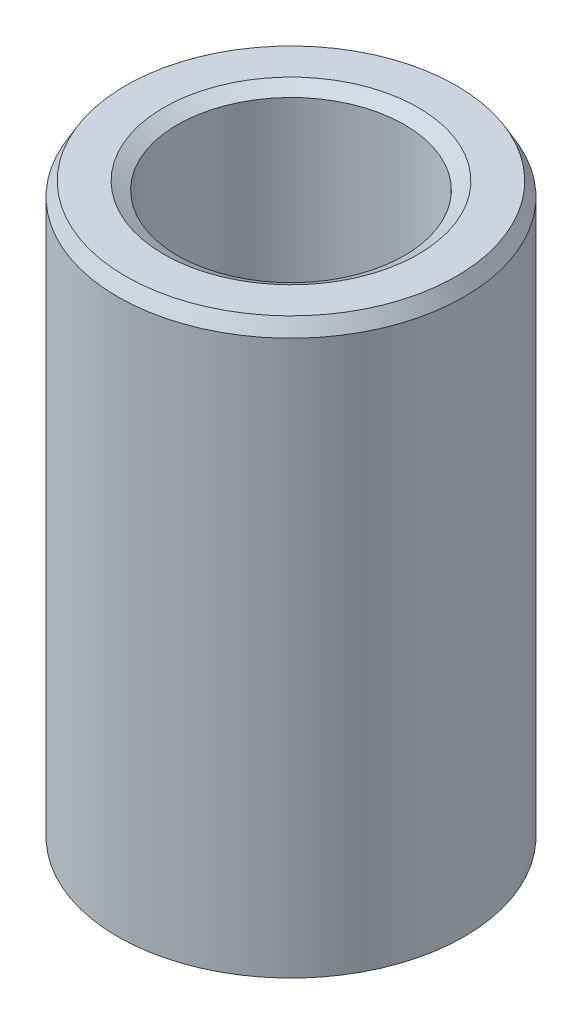
ISO-10303-21;
HEADER;
FILE_DESCRIPTION(('STEP AP214'),'2;1');
FILE_NAME('part.step','',(''),(''),'','','');
FILE_SCHEMA(('AUTOMOTIVE_DESIGN { 1 0 10303 214 1 1 1 1 }'));
ENDSEC;
DATA;
#1=APPLICATION_CONTEXT('core data for automotive mechanical design processes');
#2=APPLICATION_PROTOCOL_DEFINITION('international standard','automotive_design',2000,#1);
#3=PRODUCT_CONTEXT('',#1,'mechanical');
#4=PRODUCT('Part','Part','',(#3));
#5=PRODUCT_RELATED_PRODUCT_CATEGORY('part','',(#4));
#6=PRODUCT_DEFINITION_FORMATION('','',#4);
#7=PRODUCT_DEFINITION_CONTEXT('part definition',#1,'design');
#8=PRODUCT_DEFINITION('design','',#6,#7);
#9=PRODUCT_DEFINITION_SHAPE('','',#8);
#10=(LENGTH_UNIT() NAMED_UNIT(*) SI_UNIT(.MILLI.,.METRE.));
#11=(NAMED_UNIT(*) PLANE_ANGLE_UNIT() SI_UNIT($,.RADIAN.));
#12=(NAMED_UNIT(*) SI_UNIT($,.STERADIAN.) SOLID_ANGLE_UNIT());
#13=UNCERTAINTY_MEASURE_WITH_UNIT(LENGTH_MEASURE(1.E-05),#10,'distance_accuracy_value','');
#14=(GEOMETRIC_REPRESENTATION_CONTEXT(3) GLOBAL_UNCERTAINTY_ASSIGNED_CONTEXT((#13)) GLOBAL_UNIT_ASSIGNED_CONTEXT((#10,
#11,#12)) REPRESENTATION_CONTEXT('',''));
#15=CARTESIAN_POINT('',(0.,0.,0.));
#16=DIRECTION('',(0.,0.,1.));
#17=DIRECTION('',(1.,0.,0.));
#18=AXIS2_PLACEMENT_3D('',#15,#16,#17);
#19=CARTESIAN_POINT('',(0.,166.203326574987,0.));
#20=DIRECTION('',(0.,-1.,0.));
#21=DIRECTION('',(0.,0.,-1.));
#22=AXIS2_PLACEMENT_3D('',#19,#20,#21);
#23=CYLINDRICAL_SURFACE('',#22,50.);
#24=CARTESIAN_POINT('',(0.,2.29415611654041,0.));
#25=DIRECTION('',(0.,1.,0.));
#26=DIRECTION('',(0.,0.,1.));
#27=AXIS2_PLACEMENT_3D('',#24,#25,#26);
#28=CIRCLE('',#27,50.);
#29=CARTESIAN_POINT('',(0.,2.29415611654041,-50.));
#30=VERTEX_POINT('',#29);
#31=EDGE_CURVE('E10',#30,#30,#28,.T.);
#32=CARTESIAN_POINT('',(0.,162.229731620644,0.));
#33=DIRECTION('',(0.,1.,0.));
#34=DIRECTION('',(0.,0.,1.));
#35=AXIS2_PLACEMENT_3D('',#32,#33,#34);
#36=CIRCLE('',#35,50.);
#37=CARTESIAN_POINT('',(0.,162.229731620644,-50.));
#38=VERTEX_POINT('',#37);
#39=EDGE_CURVE('E50',#38,#38,#36,.F.);
#40=CARTESIAN_POINT('',(0.,2.29415611654041,-50.));
#41=CARTESIAN_POINT('',(0.,3.96015169470816,-50.));
#42=CARTESIAN_POINT('',(0.,5.62614727287591,-50.));
#43=CARTESIAN_POINT('',(0.,8.9581384292114,-50.));
#44=CARTESIAN_POINT('',(0.,10.6241340073792,-50.));
#45=CARTESIAN_POINT('',(0.,13.9561251637146,-50.));
#46=CARTESIAN_POINT('',(0.,15.6221207418824,-50.));
#47=CARTESIAN_POINT('',(0.,18.9541118982179,-50.));
#48=CARTESIAN_POINT('',(0.,20.6201074763856,-50.));
#49=CARTESIAN_POINT('',(0.,23.9520986327211,-50.));
#50=CARTESIAN_POINT('',(0.,25.6180942108889,-50.));
#51=CARTESIAN_POINT('',(0.,28.9500853672244,-50.));
#52=CARTESIAN_POINT('',(0.,30.6160809453921,-50.));
#53=CARTESIAN_POINT('',(0.,33.9480721017276,-50.));
#54=CARTESIAN_POINT('',(0.,35.6140676798954,-50.));
#55=CARTESIAN_POINT('',(0.,38.9460588362308,-50.));
#56=CARTESIAN_POINT('',(0.,40.6120544143986,-50.));
#57=CARTESIAN_POINT('',(0.,43.9440455707341,-50.));
#58=CARTESIAN_POINT('',(0.,45.6100411489018,-50.));
#59=CARTESIAN_POINT('',(0.,48.9420323052373,-50.));
#60=CARTESIAN_POINT('',(0.,50.6080278834051,-50.));
#61=CARTESIAN_POINT('',(0.,53.9400190397406,-50.));
#62=CARTESIAN_POINT('',(0.,55.6060146179083,-50.));
#63=CARTESIAN_POINT('',(0.,58.9380057742438,-50.));
#64=CARTESIAN_POINT('',(0.,60.6040013524115,-50.));
#65=CARTESIAN_POINT('',(0.,63.935992508747,-50.));
#66=CARTESIAN_POINT('',(0.,65.6019880869148,-50.));
#67=CARTESIAN_POINT('',(0.,68.9339792432503,-50.));
#68=CARTESIAN_POINT('',(0.,70.599974821418,-50.));
#69=CARTESIAN_POINT('',(0.,73.9319659777535,-50.));
#70=CARTESIAN_POINT('',(0.,75.5979615559213,-50.));
#71=CARTESIAN_POINT('',(0.,78.9299527122568,-50.));
#72=CARTESIAN_POINT('',(0.,80.5959482904245,-50.));
#73=CARTESIAN_POINT('',(0.,83.92793944676,-50.));
#74=CARTESIAN_POINT('',(0.,85.5939350249277,-50.));
#75=CARTESIAN_POINT('',(0.,88.9259261812632,-50.));
#76=CARTESIAN_POINT('',(0.,90.591921759431,-50.));
#77=CARTESIAN_POINT('',(0.,93.9239129157665,-50.));
#78=CARTESIAN_POINT('',(0.,95.5899084939342,-50.));
#79=CARTESIAN_POINT('',(0.,98.9218996502697,-50.));
#80=CARTESIAN_POINT('',(0.,100.587895228437,-50.));
#81=CARTESIAN_POINT('',(0.,103.919886384773,-50.));
#82=CARTESIAN_POINT('',(0.,105.585881962941,-50.));
#83=CARTESIAN_POINT('',(0.,108.917873119276,-50.));
#84=CARTESIAN_POINT('',(0.,110.583868697444,-50.));
#85=CARTESIAN_POINT('',(0.,113.915859853779,-50.));
#86=CARTESIAN_POINT('',(0.,115.581855431947,-50.));
#87=CARTESIAN_POINT('',(0.,118.913846588283,-50.));
#88=CARTESIAN_POINT('',(0.,120.57984216645,-50.));
#89=CARTESIAN_POINT('',(0.,123.911833322786,-50.));
#90=CARTESIAN_POINT('',(0.,125.577828900954,-50.));
#91=CARTESIAN_POINT('',(0.,128.909820057289,-50.));
#92=CARTESIAN_POINT('',(0.,130.575815635457,-50.));
#93=CARTESIAN_POINT('',(0.,133.907806791792,-50.));
#94=CARTESIAN_POINT('',(0.,135.57380236996,-50.));
#95=CARTESIAN_POINT('',(0.,138.905793526296,-50.));
#96=CARTESIAN_POINT('',(0.,140.571789104463,-50.));
#97=CARTESIAN_POINT('',(0.,143.903780260799,-50.));
#98=CARTESIAN_POINT('',(0.,145.569775838967,-50.));
#99=CARTESIAN_POINT('',(0.,148.901766995302,-50.));
#100=CARTESIAN_POINT('',(0.,150.56776257347,-50.));
#101=CARTESIAN_POINT('',(0.,153.899753729805,-50.));
#102=CARTESIAN_POINT('',(0.,155.565749307973,-50.));
#103=CARTESIAN_POINT('',(0.,158.897740464309,-50.));
#104=CARTESIAN_POINT('',(0.,160.563736042476,-50.));
#105=CARTESIAN_POINT('',(0.,162.229731620644,-50.));
#106=B_SPLINE_CURVE_WITH_KNOTS('',3,(#40,#41,#42,#43,#44,#45,#46,#47,#48,#49,#50,#51,#52,#53,
#54,#55,#56,#57,#58,#59,#60,#61,#62,#63,#64,#65,#66,#67,#68,#69,#70,#71,#72,#73,#74,#75,#76,#77,
#78,#79,#80,#81,#82,#83,#84,#85,#86,#87,#88,#89,#90,#91,#92,#93,#94,#95,#96,#97,#98,#99,#100,
#101,#102,#103,#104,#105),.UNSPECIFIED.,.F.,.F.,(4,2,2,2,2,2,2,2,2,2,2,2,2,2,2,2,2,2,2,2,2,2,2,
2,2,2,2,2,2,2,2,2,4),(0.,4.99798673450325,9.99597346900649,14.9939602035097,19.991946938013,
24.9899336725162,29.9879204070194,34.9859071415227,39.9838938760259,44.9818806105292,
49.9798673450324,54.9778540795356,59.9758408140389,64.9738275485421,69.9718142830454,
74.9698010175486,79.9677877520518,84.9657744865551,89.9637612210583,94.9617479555616,
99.9597346900648,104.957721424568,109.955708159071,114.953694893575,119.951681628078,
124.949668362581,129.947655097084,134.945641831587,139.943628566091,144.941615300594,
149.939602035097,154.9375887696,159.935575504104),.UNSPECIFIED.);
#107=EDGE_CURVE('BSEAM39',#30,#38,#106,.T.);
#108=ORIENTED_EDGE('',*,*,#31,.T.);
#109=ORIENTED_EDGE('',*,*,#39,.T.);
#110=ORIENTED_EDGE('',*,*,#107,.T.);
#111=ORIENTED_EDGE('',*,*,#107,.F.);
#112=EDGE_LOOP('',(#108,#110,#109,#111));
#113=FACE_BOUND('',#112,.T.);
#114=ADVANCED_FACE('F39',(#113),#23,.T.);
#115=CARTESIAN_POINT('',(0.,166.203326574987,0.));
#116=DIRECTION('',(0.,1.,0.));
#117=DIRECTION('',(0.,0.,1.));
#118=AXIS2_PLACEMENT_3D('',#115,#116,#117);
#119=PLANE('',#118);
#120=CARTESIAN_POINT('',(0.,166.203326574987,0.));
#121=DIRECTION('',(0.,1.,0.));
#122=DIRECTION('',(0.,0.,1.));
#123=AXIS2_PLACEMENT_3D('',#120,#121,#122);
#124=CIRCLE('',#123,36.715613234674);
#125=CARTESIAN_POINT('',(0.,166.203326574987,36.715613234674));
#126=VERTEX_POINT('',#125);
#127=EDGE_CURVE('E58',#126,#126,#124,.F.);
#128=ORIENTED_EDGE('',*,*,#127,.T.);
#129=EDGE_LOOP('',(#128));
#130=FACE_BOUND('',#129,.T.);
#131=CARTESIAN_POINT('',(0.,166.203326574987,0.));
#132=DIRECTION('',(0.,1.,0.));
#133=DIRECTION('',(0.,0.,1.));
#134=AXIS2_PLACEMENT_3D('',#131,#132,#133);
#135=CIRCLE('',#134,47.7058438834597);
#136=CARTESIAN_POINT('',(0.,166.203326574987,47.7058438834597));
#137=VERTEX_POINT('',#136);
#138=EDGE_CURVE('E61',#137,#137,#135,.T.);
#139=ORIENTED_EDGE('',*,*,#138,.T.);
#140=EDGE_LOOP('',(#139));
#141=FACE_BOUND('',#140,.T.);
#142=ADVANCED_FACE('F88',(#130,#141),#119,.T.);
#143=CARTESIAN_POINT('',(0.,0.,0.));
#144=DIRECTION('',(0.,1.,0.));
#145=DIRECTION('',(0.,0.,1.));
#146=AXIS2_PLACEMENT_3D('',#143,#144,#145);
#147=PLANE('',#146);
#148=CARTESIAN_POINT('',(0.,0.,0.));
#149=DIRECTION('',(0.,1.,0.));
#150=DIRECTION('',(0.,0.,1.));
#151=AXIS2_PLACEMENT_3D('',#148,#149,#150);
#152=CIRCLE('',#151,35.0361743968715);
#153=CARTESIAN_POINT('',(0.,0.,35.0361743968715));
#154=VERTEX_POINT('',#153);
#155=EDGE_CURVE('E51',#154,#154,#152,.T.);
#156=ORIENTED_EDGE('',*,*,#155,.T.);
#157=EDGE_LOOP('',(#156));
#158=FACE_BOUND('',#157,.T.);
#159=CARTESIAN_POINT('',(0.,0.,0.));
#160=DIRECTION('',(0.,1.,0.));
#161=DIRECTION('',(0.,0.,1.));
#162=AXIS2_PLACEMENT_3D('',#159,#160,#161);
#163=CIRCLE('',#162,46.0264050456571);
#164=CARTESIAN_POINT('',(0.,0.,46.0264050456571));
#165=VERTEX_POINT('',#164);
#166=EDGE_CURVE('E54',#165,#165,#163,.F.);
#167=ORIENTED_EDGE('',*,*,#166,.T.);
#168=EDGE_LOOP('',(#167));
#169=FACE_BOUND('',#168,.T.);
#170=ADVANCED_FACE('F83',(#158,#169),#147,.F.);
#171=CARTESIAN_POINT('',(0.,166.203326574987,0.));
#172=DIRECTION('',(0.,-1.,0.));
#173=DIRECTION('',(0.,0.,-1.));
#174=AXIS2_PLACEMENT_3D('',#171,#172,#173);
#175=CYLINDRICAL_SURFACE('',#174,32.7420182803311);
#176=CARTESIAN_POINT('',(0.,163.909170458446,0.));
#177=DIRECTION('',(0.,1.,0.));
#178=DIRECTION('',(0.,0.,1.));
#179=AXIS2_PLACEMENT_3D('',#176,#177,#178);
#180=CIRCLE('',#179,32.7420182803311);
#181=CARTESIAN_POINT('',(0.,163.909170458446,-32.7420182803311));
#182=VERTEX_POINT('',#181);
#183=EDGE_CURVE('E67',#182,#182,#180,.T.);
#184=CARTESIAN_POINT('',(0.,3.97359495434277,0.));
#185=DIRECTION('',(0.,1.,0.));
#186=DIRECTION('',(0.,0.,1.));
#187=AXIS2_PLACEMENT_3D('',#184,#185,#186);
#188=CIRCLE('',#187,32.7420182803311);
#189=CARTESIAN_POINT('',(0.,3.97359495434277,-32.7420182803311));
#190=VERTEX_POINT('',#189);
#191=EDGE_CURVE('E69',#190,#190,#188,.F.);
#192=CARTESIAN_POINT('',(0.,163.909170458446,-32.7420182803311));
#193=CARTESIAN_POINT('',(0.,162.243174880279,-32.7420182803311));
#194=CARTESIAN_POINT('',(0.,160.577179302111,-32.7420182803311));
#195=CARTESIAN_POINT('',(0.,157.245188145776,-32.7420182803311));
#196=CARTESIAN_POINT('',(0.,155.579192567608,-32.7420182803311));
#197=CARTESIAN_POINT('',(0.,152.247201411272,-32.7420182803311));
#198=CARTESIAN_POINT('',(0.,150.581205833104,-32.7420182803311));
#199=CARTESIAN_POINT('',(0.,147.249214676769,-32.7420182803311));
#200=CARTESIAN_POINT('',(0.,145.583219098601,-32.7420182803311));
#201=CARTESIAN_POINT('',(0.,142.251227942266,-32.7420182803311));
#202=CARTESIAN_POINT('',(0.,140.585232364098,-32.7420182803311));
#203=CARTESIAN_POINT('',(0.,137.253241207763,-32.7420182803311));
#204=CARTESIAN_POINT('',(0.,135.587245629595,-32.7420182803311));
#205=CARTESIAN_POINT('',(0.,132.255254473259,-32.7420182803311));
#206=CARTESIAN_POINT('',(0.,130.589258895092,-32.7420182803311));
#207=CARTESIAN_POINT('',(0.,127.257267738756,-32.7420182803311));
#208=CARTESIAN_POINT('',(0.,125.591272160588,-32.7420182803311));
#209=CARTESIAN_POINT('',(0.,122.259281004253,-32.7420182803311));
#210=CARTESIAN_POINT('',(0.,120.593285426085,-32.7420182803311));
#211=CARTESIAN_POINT('',(0.,117.26129426975,-32.7420182803311));
#212=CARTESIAN_POINT('',(0.,115.595298691582,-32.7420182803311));
#213=CARTESIAN_POINT('',(0.,112.263307535246,-32.7420182803311));
#214=CARTESIAN_POINT('',(0.,110.597311957079,-32.7420182803311));
#215=CARTESIAN_POINT('',(0.,107.265320800743,-32.7420182803311));
#216=CARTESIAN_POINT('',(0.,105.599325222575,-32.7420182803311));
#217=CARTESIAN_POINT('',(0.,102.26733406624,-32.7420182803311));
#218=CARTESIAN_POINT('',(0.,100.601338488072,-32.7420182803311));
#219=CARTESIAN_POINT('',(0.,97.2693473317366,-32.7420182803311));
#220=CARTESIAN_POINT('',(0.,95.6033517535689,-32.7420182803311));
#221=CARTESIAN_POINT('',(0.,92.2713605972334,-32.7420182803311));
#222=CARTESIAN_POINT('',(0.,90.6053650190656,-32.7420182803311));
#223=CARTESIAN_POINT('',(0.,87.2733738627301,-32.7420182803311));
#224=CARTESIAN_POINT('',(0.,85.6073782845624,-32.7420182803311));
#225=CARTESIAN_POINT('',(0.,82.2753871282269,-32.7420182803311));
#226=CARTESIAN_POINT('',(0.,80.6093915500591,-32.7420182803311));
#227=CARTESIAN_POINT('',(0.,77.2774003937237,-32.7420182803311));
#228=CARTESIAN_POINT('',(0.,75.6114048155559,-32.7420182803311));
#229=CARTESIAN_POINT('',(0.,72.2794136592204,-32.7420182803311));
#230=CARTESIAN_POINT('',(0.,70.6134180810527,-32.7420182803311));
#231=CARTESIAN_POINT('',(0.,67.2814269247172,-32.7420182803311));
#232=CARTESIAN_POINT('',(0.,65.6154313465494,-32.7420182803311));
#233=CARTESIAN_POINT('',(0.,62.2834401902139,-32.7420182803311));
#234=CARTESIAN_POINT('',(0.,60.6174446120462,-32.7420182803311));
#235=CARTESIAN_POINT('',(0.,57.2854534557107,-32.7420182803311));
#236=CARTESIAN_POINT('',(0.,55.6194578775429,-32.7420182803311));
#237=CARTESIAN_POINT('',(0.,52.2874667212074,-32.7420182803311));
#238=CARTESIAN_POINT('',(0.,50.6214711430397,-32.7420182803311));
#239=CARTESIAN_POINT('',(0.,47.2894799867042,-32.7420182803311));
#240=CARTESIAN_POINT('',(0.,45.6234844085365,-32.7420182803311));
#241=CARTESIAN_POINT('',(0.,42.291493252201,-32.7420182803311));
#242=CARTESIAN_POINT('',(0.,40.6254976740332,-32.7420182803311));
#243=CARTESIAN_POINT('',(0.,37.2935065176977,-32.7420182803311));
#244=CARTESIAN_POINT('',(0.,35.62751093953,-32.7420182803311));
#245=CARTESIAN_POINT('',(0.,32.2955197831945,-32.7420182803311));
#246=CARTESIAN_POINT('',(0.,30.6295242050267,-32.7420182803311));
#247=CARTESIAN_POINT('',(0.,27.2975330486912,-32.7420182803311));
#248=CARTESIAN_POINT('',(0.,25.6315374705235,-32.7420182803311));
#249=CARTESIAN_POINT('',(0.,22.299546314188,-32.7420182803311));
#250=CARTESIAN_POINT('',(0.,20.6335507360202,-32.7420182803311));
#251=CARTESIAN_POINT('',(0.,17.3015595796848,-32.7420182803311));
#252=CARTESIAN_POINT('',(0.,15.635564001517,-32.7420182803311));
#253=CARTESIAN_POINT('',(0.,12.3035728451815,-32.7420182803311));
#254=CARTESIAN_POINT('',(0.,10.6375772670138,-32.7420182803311));
#255=CARTESIAN_POINT('',(0.,7.30558611067827,-32.7420182803311));
#256=CARTESIAN_POINT('',(0.,5.63959053251052,-32.7420182803311));
#257=CARTESIAN_POINT('',(0.,3.97359495434277,-32.7420182803311));
#258=B_SPLINE_CURVE_WITH_KNOTS('',3,(#192,#193,#194,#195,#196,#197,#198,#199,#200,#201,#202,
#203,#204,#205,#206,#207,#208,#209,#210,#211,#212,#213,#214,#215,#216,#217,#218,#219,#220,#221,
#222,#223,#224,#225,#226,#227,#228,#229,#230,#231,#232,#233,#234,#235,#236,#237,#238,#239,#240,
#241,#242,#243,#244,#245,#246,#247,#248,#249,#250,#251,#252,#253,#254,#255,#256,#257),
.UNSPECIFIED.,.F.,.F.,(4,2,2,2,2,2,2,2,2,2,2,2,2,2,2,2,2,2,2,2,2,2,2,2,2,2,2,2,2,2,2,2,4),(0.,
4.99798673450322,9.99597346900646,14.9939602035097,19.991946938013,24.9899336725162,
29.9879204070194,34.9859071415227,39.9838938760259,44.9818806105292,49.9798673450324,
54.9778540795356,59.9758408140389,64.9738275485421,69.9718142830454,74.9698010175486,
79.9677877520518,84.9657744865551,89.9637612210583,94.9617479555616,99.9597346900648,
104.957721424568,109.955708159071,114.953694893575,119.951681628078,124.949668362581,
129.947655097084,134.945641831587,139.943628566091,144.941615300594,149.939602035097,
154.9375887696,159.935575504104),.UNSPECIFIED.);
#259=EDGE_CURVE('BSEAM71',#182,#190,#258,.T.);
#260=ORIENTED_EDGE('',*,*,#183,.T.);
#261=ORIENTED_EDGE('',*,*,#191,.T.);
#262=ORIENTED_EDGE('',*,*,#259,.T.);
#263=ORIENTED_EDGE('',*,*,#259,.F.);
#264=EDGE_LOOP('',(#260,#262,#261,#263));
#265=FACE_BOUND('',#264,.T.);
#266=ADVANCED_FACE('F71',(#265),#175,.F.);
#267=CARTESIAN_POINT('',(0.,163.909170458446,0.));
#268=DIRECTION('',(0.,1.,0.));
#269=DIRECTION('',(0.,0.,1.));
#270=AXIS2_PLACEMENT_3D('',#267,#268,#269);
#271=CONICAL_SURFACE('',#270,32.7420182803311,1.0471975511966);
#272=ORIENTED_EDGE('',*,*,#127,.F.);
#273=EDGE_LOOP('',(#272));
#274=FACE_BOUND('',#273,.T.);
#275=ORIENTED_EDGE('',*,*,#183,.F.);
#276=EDGE_LOOP('',(#275));
#277=FACE_BOUND('',#276,.T.);
#278=ADVANCED_FACE('F77',(#274,#277),#271,.F.);
#279=CARTESIAN_POINT('',(0.,0.,0.));
#280=DIRECTION('',(0.,-1.,0.));
#281=DIRECTION('',(0.,0.,-1.));
#282=AXIS2_PLACEMENT_3D('',#279,#280,#281);
#283=CONICAL_SURFACE('',#282,35.0361743968715,0.523598775598294);
#284=ORIENTED_EDGE('',*,*,#191,.F.);
#285=EDGE_LOOP('',(#284));
#286=FACE_BOUND('',#285,.T.);
#287=ORIENTED_EDGE('',*,*,#155,.F.);
#288=EDGE_LOOP('',(#287));
#289=FACE_BOUND('',#288,.T.);
#290=ADVANCED_FACE('F73',(#286,#289),#283,.F.);
#291=CARTESIAN_POINT('',(0.,2.29415611654041,0.));
#292=DIRECTION('',(0.,1.,0.));
#293=DIRECTION('',(0.,0.,1.));
#294=AXIS2_PLACEMENT_3D('',#291,#292,#293);
#295=CONICAL_SURFACE('',#294,50.,1.0471975511966);
#296=ORIENTED_EDGE('',*,*,#166,.F.);
#297=EDGE_LOOP('',(#296));
#298=FACE_BOUND('',#297,.T.);
#299=ORIENTED_EDGE('',*,*,#31,.F.);
#300=EDGE_LOOP('',(#299));
#301=FACE_BOUND('',#300,.T.);
#302=ADVANCED_FACE('F76',(#298,#301),#295,.T.);
#303=CARTESIAN_POINT('',(0.,166.203326574987,0.));
#304=DIRECTION('',(0.,-1.,0.));
#305=DIRECTION('',(0.,0.,-1.));
#306=AXIS2_PLACEMENT_3D('',#303,#304,#305);
#307=CONICAL_SURFACE('',#306,47.7058438834597,0.523598775598293);
#308=ORIENTED_EDGE('',*,*,#39,.F.);
#309=EDGE_LOOP('',(#308));
#310=FACE_BOUND('',#309,.T.);
#311=ORIENTED_EDGE('',*,*,#138,.F.);
#312=EDGE_LOOP('',(#311));
#313=FACE_BOUND('',#312,.T.);
#314=ADVANCED_FACE('F45',(#310,#313),#307,.T.);
#315=CLOSED_SHELL('',(#114,#142,#170,#266,#278,#290,#302,#314));
#316=MANIFOLD_SOLID_BREP('B2',#315);
#317=ADVANCED_BREP_SHAPE_REPRESENTATION('',(#18,#316),#14);
#318=SHAPE_DEFINITION_REPRESENTATION(#9,#317);
ENDSEC;
END-ISO-10303-21;
